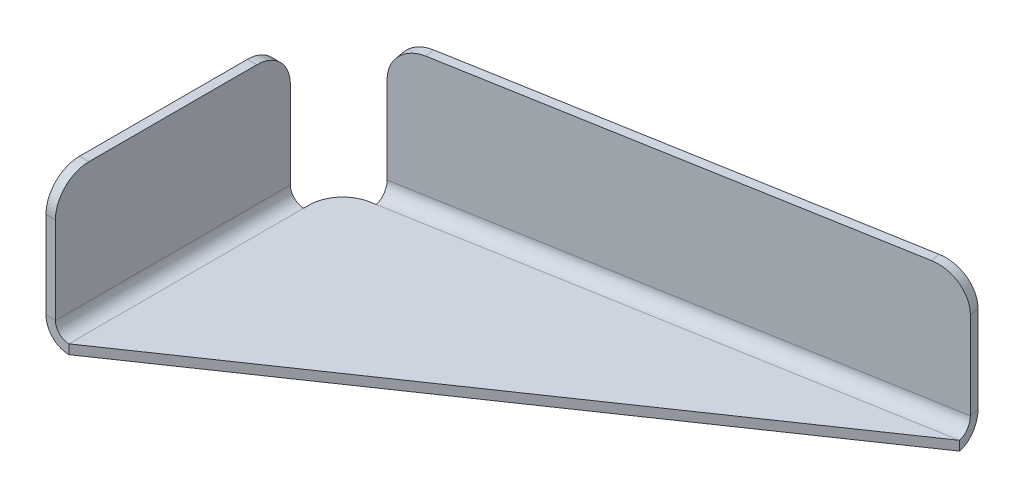
ISO-10303-21;
HEADER;
FILE_DESCRIPTION(('STEP AP214'),'2;1');
FILE_NAME('part.step','',(''),(''),'','','');
FILE_SCHEMA(('AUTOMOTIVE_DESIGN { 1 0 10303 214 1 1 1 1 }'));
ENDSEC;
DATA;
#1=APPLICATION_CONTEXT('core data for automotive mechanical design processes');
#2=APPLICATION_PROTOCOL_DEFINITION('international standard','automotive_design',2000,#1);
#3=PRODUCT_CONTEXT('',#1,'mechanical');
#4=PRODUCT('Part','Part','',(#3));
#5=PRODUCT_RELATED_PRODUCT_CATEGORY('part','',(#4));
#6=PRODUCT_DEFINITION_FORMATION('','',#4);
#7=PRODUCT_DEFINITION_CONTEXT('part definition',#1,'design');
#8=PRODUCT_DEFINITION('design','',#6,#7);
#9=PRODUCT_DEFINITION_SHAPE('','',#8);
#10=(LENGTH_UNIT() NAMED_UNIT(*) SI_UNIT(.MILLI.,.METRE.));
#11=(NAMED_UNIT(*) PLANE_ANGLE_UNIT() SI_UNIT($,.RADIAN.));
#12=(NAMED_UNIT(*) SI_UNIT($,.STERADIAN.) SOLID_ANGLE_UNIT());
#13=UNCERTAINTY_MEASURE_WITH_UNIT(LENGTH_MEASURE(1.E-05),#10,'distance_accuracy_value','');
#14=(GEOMETRIC_REPRESENTATION_CONTEXT(3) GLOBAL_UNCERTAINTY_ASSIGNED_CONTEXT((#13)) GLOBAL_UNIT_ASSIGNED_CONTEXT((#10,
#11,#12)) REPRESENTATION_CONTEXT('',''));
#15=CARTESIAN_POINT('',(0.,0.,0.));
#16=DIRECTION('',(0.,0.,1.));
#17=DIRECTION('',(1.,0.,0.));
#18=AXIS2_PLACEMENT_3D('',#15,#16,#17);
#19=CARTESIAN_POINT('',(39.3923101204883,-0.7,-6.94592710667709));
#20=DIRECTION('',(-0.173648177666927,0.,-0.984807753012209));
#21=DIRECTION('',(-0.984807753012209,0.,0.173648177666927));
#22=AXIS2_PLACEMENT_3D('',#19,#20,#21);
#23=PLANE('',#22);
#24=DIRECTION('',(-0.984807753012209,0.,0.173648177666927));
#25=VECTOR('',#24,1.);
#26=CARTESIAN_POINT('',(39.3923101204883,-0.7,-6.94592710667709));
#27=LINE('',#26,#25);
#28=CARTESIAN_POINT('',(2.46201938253052,-0.7,-0.434120444167318));
#29=VERTEX_POINT('',#28);
#30=CARTESIAN_POINT('',(2.06587955583269,-0.7,-0.364270304587316));
#31=VERTEX_POINT('',#30);
#32=EDGE_CURVE('E321',#29,#31,#27,.T.);
#33=ORIENTED_EDGE('',*,*,#32,.T.);
#34=DIRECTION('',(0.,1.,0.));
#35=VECTOR('',#34,1.);
#36=CARTESIAN_POINT('',(2.06587955583269,-0.7,-0.364270304587315));
#37=LINE('',#36,#35);
#38=CARTESIAN_POINT('',(2.06587955583269,0.,-0.364270304587316));
#39=VERTEX_POINT('',#38);
#40=EDGE_CURVE('E305',#31,#39,#37,.T.);
#41=ORIENTED_EDGE('',*,*,#40,.T.);
#42=DIRECTION('',(-0.984807753012209,0.,0.173648177666927));
#43=VECTOR('',#42,1.);
#44=CARTESIAN_POINT('',(39.3923101204883,0.,-6.94592710667709));
#45=LINE('',#44,#43);
#46=CARTESIAN_POINT('',(2.46201938253052,0.,-0.434120444167317));
#47=VERTEX_POINT('',#46);
#48=EDGE_CURVE('E332',#47,#39,#45,.T.);
#49=ORIENTED_EDGE('',*,*,#48,.F.);
#50=DIRECTION('',(0.,-1.,0.));
#51=VECTOR('',#50,1.);
#52=CARTESIAN_POINT('',(2.46201938253052,0.,-0.434120444167317));
#53=LINE('',#52,#51);
#54=EDGE_CURVE('E254',#47,#29,#53,.T.);
#55=ORIENTED_EDGE('',*,*,#54,.T.);
#56=EDGE_LOOP('',(#33,#41,#49,#55));
#57=FACE_BOUND('',#56,.T.);
#58=ADVANCED_FACE('F76',(#57),#23,.T.);
#59=CARTESIAN_POINT('',(0.,-0.7,20.));
#60=DIRECTION('',(0.564588205124679,0.,0.825372739211862));
#61=DIRECTION('',(0.825372739211862,0.,-0.564588205124679));
#62=AXIS2_PLACEMENT_3D('',#59,#60,#61);
#63=PLANE('',#62);
#64=DIRECTION('',(0.825372739211862,0.,-0.564588205124679));
#65=VECTOR('',#64,1.);
#66=CARTESIAN_POINT('',(0.,0.,20.));
#67=LINE('',#66,#65);
#68=CARTESIAN_POINT('',(0.,0.,20.));
#69=VERTEX_POINT('',#68);
#70=CARTESIAN_POINT('',(39.3923101204883,0.,-6.94592710667709));
#71=VERTEX_POINT('',#70);
#72=EDGE_CURVE('E311',#69,#71,#67,.T.);
#73=ORIENTED_EDGE('',*,*,#72,.F.);
#74=DIRECTION('',(0.,1.,0.));
#75=VECTOR('',#74,1.);
#76=CARTESIAN_POINT('',(0.,-0.7,20.));
#77=LINE('',#76,#75);
#78=CARTESIAN_POINT('',(0.,-0.7,20.));
#79=VERTEX_POINT('',#78);
#80=EDGE_CURVE('E324',#79,#69,#77,.T.);
#81=ORIENTED_EDGE('',*,*,#80,.F.);
#82=DIRECTION('',(0.825372739211862,0.,-0.564588205124679));
#83=VECTOR('',#82,1.);
#84=CARTESIAN_POINT('',(0.,-0.7,20.));
#85=LINE('',#84,#83);
#86=CARTESIAN_POINT('',(39.3923101204884,-0.700000000000008,-6.94592710667709));
#87=VERTEX_POINT('',#86);
#88=EDGE_CURVE('E327',#79,#87,#85,.T.);
#89=ORIENTED_EDGE('',*,*,#88,.T.);
#90=DIRECTION('',(0.,1.,0.));
#91=VECTOR('',#90,1.);
#92=CARTESIAN_POINT('',(39.3923101204883,-0.7,-6.94592710667709));
#93=LINE('',#92,#91);
#94=EDGE_CURVE('E273',#87,#71,#93,.T.);
#95=ORIENTED_EDGE('',*,*,#94,.T.);
#96=EDGE_LOOP('',(#73,#81,#89,#95));
#97=FACE_BOUND('',#96,.T.);
#98=ADVANCED_FACE('F400',(#97),#63,.T.);
#99=CARTESIAN_POINT('',(0.,-0.7,0.));
#100=DIRECTION('',(-1.,0.,0.));
#101=DIRECTION('',(0.,0.,1.));
#102=AXIS2_PLACEMENT_3D('',#99,#100,#101);
#103=PLANE('',#102);
#104=DIRECTION('',(0.,0.,1.));
#105=VECTOR('',#104,1.);
#106=CARTESIAN_POINT('',(0.,0.,0.));
#107=LINE('',#106,#105);
#108=CARTESIAN_POINT('',(0.,0.,2.09774907794321));
#109=VERTEX_POINT('',#108);
#110=CARTESIAN_POINT('',(0.,0.,2.5));
#111=VERTEX_POINT('',#110);
#112=EDGE_CURVE('E308',#109,#111,#107,.T.);
#113=ORIENTED_EDGE('',*,*,#112,.F.);
#114=DIRECTION('',(0.,1.,0.));
#115=VECTOR('',#114,1.);
#116=CARTESIAN_POINT('',(0.,-0.7,2.09774907794321));
#117=LINE('',#116,#115);
#118=CARTESIAN_POINT('',(0.,-0.7,2.09774907794321));
#119=VERTEX_POINT('',#118);
#120=EDGE_CURVE('E84',#109,#119,#117,.F.);
#121=ORIENTED_EDGE('',*,*,#120,.T.);
#122=DIRECTION('',(0.,0.,1.));
#123=VECTOR('',#122,1.);
#124=CARTESIAN_POINT('',(0.,-0.7,0.));
#125=LINE('',#124,#123);
#126=CARTESIAN_POINT('',(0.,-0.699999999999999,2.5));
#127=VERTEX_POINT('',#126);
#128=EDGE_CURVE('E348',#119,#127,#125,.T.);
#129=ORIENTED_EDGE('',*,*,#128,.T.);
#130=DIRECTION('',(0.,-1.,0.));
#131=VECTOR('',#130,1.);
#132=CARTESIAN_POINT('',(0.,0.,2.5));
#133=LINE('',#132,#131);
#134=EDGE_CURVE('E328',#111,#127,#133,.T.);
#135=ORIENTED_EDGE('',*,*,#134,.F.);
#136=EDGE_LOOP('',(#113,#121,#129,#135));
#137=FACE_BOUND('',#136,.T.);
#138=ADVANCED_FACE('F362',(#137),#103,.T.);
#139=CARTESIAN_POINT('',(0.,-0.7,0.));
#140=DIRECTION('',(0.,1.,0.));
#141=DIRECTION('',(0.,0.,1.));
#142=AXIS2_PLACEMENT_3D('',#139,#140,#141);
#143=PLANE('',#142);
#144=ORIENTED_EDGE('',*,*,#128,.F.);
#145=CARTESIAN_POINT('',(2.5,-0.7,2.09774907794321));
#146=DIRECTION('',(0.,1.,0.));
#147=DIRECTION('',(0.,0.,1.));
#148=AXIS2_PLACEMENT_3D('',#145,#146,#147);
#149=CIRCLE('',#148,2.5);
#150=EDGE_CURVE('E13',#119,#31,#149,.F.);
#151=ORIENTED_EDGE('',*,*,#150,.T.);
#152=ORIENTED_EDGE('',*,*,#32,.F.);
#153=EDGE_CURVE('E207',#87,#29,#27,.T.);
#154=ORIENTED_EDGE('',*,*,#153,.F.);
#155=ORIENTED_EDGE('',*,*,#88,.F.);
#156=DIRECTION('',(0.,0.,1.));
#157=VECTOR('',#156,1.);
#158=CARTESIAN_POINT('',(0.,-0.699999999999999,20.));
#159=LINE('',#158,#157);
#160=EDGE_CURVE('E334',#79,#127,#159,.F.);
#161=ORIENTED_EDGE('',*,*,#160,.T.);
#162=EDGE_LOOP('',(#144,#151,#152,#154,#155,#161));
#163=FACE_BOUND('',#162,.T.);
#164=ADVANCED_FACE('F357',(#163),#143,.F.);
#165=CARTESIAN_POINT('',(0.,0.,0.));
#166=DIRECTION('',(0.,1.,0.));
#167=DIRECTION('',(0.,0.,1.));
#168=AXIS2_PLACEMENT_3D('',#165,#166,#167);
#169=PLANE('',#168);
#170=ORIENTED_EDGE('',*,*,#48,.T.);
#171=CARTESIAN_POINT('',(2.5,0.,2.09774907794321));
#172=DIRECTION('',(0.,1.,0.));
#173=DIRECTION('',(0.,0.,1.));
#174=AXIS2_PLACEMENT_3D('',#171,#172,#173);
#175=CIRCLE('',#174,2.5);
#176=EDGE_CURVE('E98',#39,#109,#175,.T.);
#177=ORIENTED_EDGE('',*,*,#176,.T.);
#178=ORIENTED_EDGE('',*,*,#112,.T.);
#179=DIRECTION('',(0.,0.,1.));
#180=VECTOR('',#179,1.);
#181=CARTESIAN_POINT('',(0.,0.,20.));
#182=LINE('',#181,#180);
#183=EDGE_CURVE('E371',#69,#111,#182,.F.);
#184=ORIENTED_EDGE('',*,*,#183,.F.);
#185=ORIENTED_EDGE('',*,*,#72,.T.);
#186=EDGE_CURVE('E312',#71,#47,#45,.T.);
#187=ORIENTED_EDGE('',*,*,#186,.T.);
#188=EDGE_LOOP('',(#170,#177,#178,#184,#185,#187));
#189=FACE_BOUND('',#188,.T.);
#190=ADVANCED_FACE('F390',(#189),#169,.T.);
#191=CARTESIAN_POINT('',(0.,1.,2.5));
#192=DIRECTION('',(0.,0.,-1.));
#193=DIRECTION('',(-1.,0.,0.));
#194=AXIS2_PLACEMENT_3D('',#191,#192,#193);
#195=PLANE('',#194);
#196=DIRECTION('',(1.,0.,0.));
#197=VECTOR('',#196,1.);
#198=CARTESIAN_POINT('',(-1.7,0.999999999999994,2.5));
#199=LINE('',#198,#197);
#200=CARTESIAN_POINT('',(-0.999999999999999,0.999999999999997,2.5));
#201=VERTEX_POINT('',#200);
#202=CARTESIAN_POINT('',(-1.7,0.999999999999994,2.5));
#203=VERTEX_POINT('',#202);
#204=EDGE_CURVE('E264',#201,#203,#199,.F.);
#205=ORIENTED_EDGE('',*,*,#204,.F.);
#206=CARTESIAN_POINT('',(0.,1.,2.5));
#207=DIRECTION('',(0.,0.,1.));
#208=DIRECTION('',(1.,0.,0.));
#209=AXIS2_PLACEMENT_3D('',#206,#207,#208);
#210=CIRCLE('',#209,0.999999999999999);
#211=EDGE_CURVE('E373',#111,#201,#210,.F.);
#212=ORIENTED_EDGE('',*,*,#211,.F.);
#213=ORIENTED_EDGE('',*,*,#134,.T.);
#214=CARTESIAN_POINT('',(0.,1.,2.5));
#215=DIRECTION('',(0.,0.,1.));
#216=DIRECTION('',(1.,0.,0.));
#217=AXIS2_PLACEMENT_3D('',#214,#215,#216);
#218=CIRCLE('',#217,1.7);
#219=EDGE_CURVE('E333',#127,#203,#218,.F.);
#220=ORIENTED_EDGE('',*,*,#219,.T.);
#221=EDGE_LOOP('',(#205,#212,#213,#220));
#222=FACE_BOUND('',#221,.T.);
#223=ADVANCED_FACE('F379',(#222),#195,.T.);
#224=CARTESIAN_POINT('',(0.,1.,20.));
#225=DIRECTION('',(0.,0.,-1.));
#226=DIRECTION('',(-1.,0.,0.));
#227=AXIS2_PLACEMENT_3D('',#224,#225,#226);
#228=PLANE('',#227);
#229=CARTESIAN_POINT('',(0.,1.,20.));
#230=DIRECTION('',(0.,0.,1.));
#231=DIRECTION('',(1.,0.,0.));
#232=AXIS2_PLACEMENT_3D('',#229,#230,#231);
#233=CIRCLE('',#232,0.999999999999999);
#234=CARTESIAN_POINT('',(-0.999999999999996,0.999999999999997,20.));
#235=VERTEX_POINT('',#234);
#236=EDGE_CURVE('E339',#235,#69,#233,.T.);
#237=ORIENTED_EDGE('',*,*,#236,.F.);
#238=DIRECTION('',(1.,0.,0.));
#239=VECTOR('',#238,1.);
#240=CARTESIAN_POINT('',(-0.999999999999998,0.999999999999997,20.));
#241=LINE('',#240,#239);
#242=CARTESIAN_POINT('',(-1.7,0.999999999999995,20.));
#243=VERTEX_POINT('',#242);
#244=EDGE_CURVE('E408',#235,#243,#241,.F.);
#245=ORIENTED_EDGE('',*,*,#244,.T.);
#246=CARTESIAN_POINT('',(0.,1.,20.));
#247=DIRECTION('',(0.,0.,1.));
#248=DIRECTION('',(1.,0.,0.));
#249=AXIS2_PLACEMENT_3D('',#246,#247,#248);
#250=CIRCLE('',#249,1.7);
#251=EDGE_CURVE('E381',#243,#79,#250,.T.);
#252=ORIENTED_EDGE('',*,*,#251,.T.);
#253=ORIENTED_EDGE('',*,*,#80,.T.);
#254=EDGE_LOOP('',(#237,#245,#252,#253));
#255=FACE_BOUND('',#254,.T.);
#256=ADVANCED_FACE('F406',(#255),#228,.F.);
#257=CARTESIAN_POINT('',(0.,1.,20.));
#258=DIRECTION('',(0.,0.,1.));
#259=DIRECTION('',(-1.,0.,0.));
#260=AXIS2_PLACEMENT_3D('',#257,#258,#259);
#261=CYLINDRICAL_SURFACE('',#260,1.7);
#262=ORIENTED_EDGE('',*,*,#160,.F.);
#263=ORIENTED_EDGE('',*,*,#251,.F.);
#264=DIRECTION('',(0.,0.,1.));
#265=VECTOR('',#264,1.);
#266=CARTESIAN_POINT('',(-1.7,0.999999999999994,2.5));
#267=LINE('',#266,#265);
#268=EDGE_CURVE('E414',#243,#203,#267,.F.);
#269=ORIENTED_EDGE('',*,*,#268,.T.);
#270=ORIENTED_EDGE('',*,*,#219,.F.);
#271=EDGE_LOOP('',(#262,#263,#269,#270));
#272=FACE_BOUND('',#271,.T.);
#273=ADVANCED_FACE('F402',(#272),#261,.T.);
#274=CARTESIAN_POINT('',(0.,1.,20.));
#275=DIRECTION('',(0.,0.,1.));
#276=DIRECTION('',(-1.,0.,0.));
#277=AXIS2_PLACEMENT_3D('',#274,#275,#276);
#278=CYLINDRICAL_SURFACE('',#277,0.999999999999999);
#279=ORIENTED_EDGE('',*,*,#183,.T.);
#280=ORIENTED_EDGE('',*,*,#211,.T.);
#281=DIRECTION('',(0.,0.,1.));
#282=VECTOR('',#281,1.);
#283=CARTESIAN_POINT('',(-1.,0.999999999999996,2.5));
#284=LINE('',#283,#282);
#285=EDGE_CURVE('E415',#201,#235,#284,.T.);
#286=ORIENTED_EDGE('',*,*,#285,.T.);
#287=ORIENTED_EDGE('',*,*,#236,.T.);
#288=EDGE_LOOP('',(#279,#280,#286,#287));
#289=FACE_BOUND('',#288,.T.);
#290=ADVANCED_FACE('F372',(#289),#278,.F.);
#291=CARTESIAN_POINT('',(-1.7,0.,2.5));
#292=DIRECTION('',(0.,0.,1.));
#293=DIRECTION('',(1.,0.,0.));
#294=AXIS2_PLACEMENT_3D('',#291,#292,#293);
#295=PLANE('',#294);
#296=DIRECTION('',(0.,-1.,0.));
#297=VECTOR('',#296,1.);
#298=CARTESIAN_POINT('',(-1.7,0.,2.5));
#299=LINE('',#298,#297);
#300=CARTESIAN_POINT('',(-1.70000000000002,7.5,2.5));
#301=VERTEX_POINT('',#300);
#302=EDGE_CURVE('E424',#301,#203,#299,.T.);
#303=ORIENTED_EDGE('',*,*,#302,.F.);
#304=DIRECTION('',(1.,0.,0.));
#305=VECTOR('',#304,1.);
#306=CARTESIAN_POINT('',(-1.70000000000002,7.5,2.5));
#307=LINE('',#306,#305);
#308=CARTESIAN_POINT('',(-1.00000000000002,7.5,2.5));
#309=VERTEX_POINT('',#308);
#310=EDGE_CURVE('E287',#301,#309,#307,.T.);
#311=ORIENTED_EDGE('',*,*,#310,.T.);
#312=DIRECTION('',(0.,1.,0.));
#313=VECTOR('',#312,1.);
#314=CARTESIAN_POINT('',(-0.999999999999996,0.,2.5));
#315=LINE('',#314,#313);
#316=EDGE_CURVE('E425',#309,#201,#315,.F.);
#317=ORIENTED_EDGE('',*,*,#316,.T.);
#318=ORIENTED_EDGE('',*,*,#204,.T.);
#319=EDGE_LOOP('',(#303,#311,#317,#318));
#320=FACE_BOUND('',#319,.T.);
#321=ADVANCED_FACE('F439',(#320),#295,.F.);
#322=CARTESIAN_POINT('',(-1.70000000000003,10.,20.));
#323=DIRECTION('',(0.,0.,-1.));
#324=DIRECTION('',(-1.,0.,0.));
#325=AXIS2_PLACEMENT_3D('',#322,#323,#324);
#326=PLANE('',#325);
#327=DIRECTION('',(0.,-1.,0.));
#328=VECTOR('',#327,1.);
#329=CARTESIAN_POINT('',(-1.00000000000003,10.,20.));
#330=LINE('',#329,#328);
#331=CARTESIAN_POINT('',(-1.00000000000002,7.5,20.));
#332=VERTEX_POINT('',#331);
#333=EDGE_CURVE('E434',#235,#332,#330,.F.);
#334=ORIENTED_EDGE('',*,*,#333,.T.);
#335=DIRECTION('',(1.,0.,0.));
#336=VECTOR('',#335,1.);
#337=CARTESIAN_POINT('',(-1.70000000000002,7.5,20.));
#338=LINE('',#337,#336);
#339=CARTESIAN_POINT('',(-1.70000000000002,7.5,20.));
#340=VERTEX_POINT('',#339);
#341=EDGE_CURVE('E303',#332,#340,#338,.F.);
#342=ORIENTED_EDGE('',*,*,#341,.T.);
#343=DIRECTION('',(0.,1.,0.));
#344=VECTOR('',#343,1.);
#345=CARTESIAN_POINT('',(-1.69999999999999,0.,20.));
#346=LINE('',#345,#344);
#347=EDGE_CURVE('E421',#243,#340,#346,.T.);
#348=ORIENTED_EDGE('',*,*,#347,.F.);
#349=ORIENTED_EDGE('',*,*,#244,.F.);
#350=EDGE_LOOP('',(#334,#342,#348,#349));
#351=FACE_BOUND('',#350,.T.);
#352=ADVANCED_FACE('F427',(#351),#326,.F.);
#353=CARTESIAN_POINT('',(-1.7,0.,0.));
#354=DIRECTION('',(1.,0.,0.));
#355=DIRECTION('',(0.,1.,0.));
#356=AXIS2_PLACEMENT_3D('',#353,#354,#355);
#357=PLANE('',#356);
#358=DIRECTION('',(0.,0.,-1.));
#359=VECTOR('',#358,1.);
#360=CARTESIAN_POINT('',(-1.70000000000003,10.,0.));
#361=LINE('',#360,#359);
#362=CARTESIAN_POINT('',(-1.70000000000003,10.,17.5));
#363=VERTEX_POINT('',#362);
#364=CARTESIAN_POINT('',(-1.70000000000003,10.,5.));
#365=VERTEX_POINT('',#364);
#366=EDGE_CURVE('E259',#363,#365,#361,.T.);
#367=ORIENTED_EDGE('',*,*,#366,.T.);
#368=CARTESIAN_POINT('',(-1.70000000000002,7.5,5.));
#369=DIRECTION('',(1.,0.,0.));
#370=DIRECTION('',(0.,1.,0.));
#371=AXIS2_PLACEMENT_3D('',#368,#369,#370);
#372=CIRCLE('',#371,2.5);
#373=EDGE_CURVE('E301',#365,#301,#372,.F.);
#374=ORIENTED_EDGE('',*,*,#373,.T.);
#375=ORIENTED_EDGE('',*,*,#302,.T.);
#376=ORIENTED_EDGE('',*,*,#268,.F.);
#377=ORIENTED_EDGE('',*,*,#347,.T.);
#378=CARTESIAN_POINT('',(-1.70000000000002,7.5,17.5));
#379=DIRECTION('',(1.,0.,0.));
#380=DIRECTION('',(0.,1.,0.));
#381=AXIS2_PLACEMENT_3D('',#378,#379,#380);
#382=CIRCLE('',#381,2.5);
#383=EDGE_CURVE('E299',#340,#363,#382,.F.);
#384=ORIENTED_EDGE('',*,*,#383,.T.);
#385=EDGE_LOOP('',(#367,#374,#375,#376,#377,#384));
#386=FACE_BOUND('',#385,.T.);
#387=ADVANCED_FACE('F420',(#386),#357,.F.);
#388=CARTESIAN_POINT('',(-0.999999999999997,0.,0.));
#389=DIRECTION('',(1.,0.,0.));
#390=DIRECTION('',(0.,1.,0.));
#391=AXIS2_PLACEMENT_3D('',#388,#389,#390);
#392=PLANE('',#391);
#393=ORIENTED_EDGE('',*,*,#316,.F.);
#394=CARTESIAN_POINT('',(-1.00000000000002,7.5,5.));
#395=DIRECTION('',(1.,0.,0.));
#396=DIRECTION('',(0.,1.,0.));
#397=AXIS2_PLACEMENT_3D('',#394,#395,#396);
#398=CIRCLE('',#397,2.5);
#399=CARTESIAN_POINT('',(-1.00000000000003,10.,5.));
#400=VERTEX_POINT('',#399);
#401=EDGE_CURVE('E292',#309,#400,#398,.T.);
#402=ORIENTED_EDGE('',*,*,#401,.T.);
#403=DIRECTION('',(0.,0.,1.));
#404=VECTOR('',#403,1.);
#405=CARTESIAN_POINT('',(-1.00000000000003,10.,2.5));
#406=LINE('',#405,#404);
#407=CARTESIAN_POINT('',(-1.00000000000003,10.,17.5));
#408=VERTEX_POINT('',#407);
#409=EDGE_CURVE('E429',#408,#400,#406,.F.);
#410=ORIENTED_EDGE('',*,*,#409,.F.);
#411=CARTESIAN_POINT('',(-1.00000000000002,7.5,17.5));
#412=DIRECTION('',(1.,0.,0.));
#413=DIRECTION('',(0.,1.,0.));
#414=AXIS2_PLACEMENT_3D('',#411,#412,#413);
#415=CIRCLE('',#414,2.5);
#416=EDGE_CURVE('E290',#408,#332,#415,.T.);
#417=ORIENTED_EDGE('',*,*,#416,.T.);
#418=ORIENTED_EDGE('',*,*,#333,.F.);
#419=ORIENTED_EDGE('',*,*,#285,.F.);
#420=EDGE_LOOP('',(#393,#402,#410,#417,#418,#419));
#421=FACE_BOUND('',#420,.T.);
#422=ADVANCED_FACE('F443',(#421),#392,.T.);
#423=CARTESIAN_POINT('',(-1.70000000000003,10.,2.5));
#424=DIRECTION('',(0.,-1.,0.));
#425=DIRECTION('',(1.,0.,0.));
#426=AXIS2_PLACEMENT_3D('',#423,#424,#425);
#427=PLANE('',#426);
#428=ORIENTED_EDGE('',*,*,#409,.T.);
#429=DIRECTION('',(1.,0.,0.));
#430=VECTOR('',#429,1.);
#431=CARTESIAN_POINT('',(-1.70000000000003,10.,5.));
#432=LINE('',#431,#430);
#433=EDGE_CURVE('E297',#400,#365,#432,.F.);
#434=ORIENTED_EDGE('',*,*,#433,.T.);
#435=ORIENTED_EDGE('',*,*,#366,.F.);
#436=DIRECTION('',(1.,0.,0.));
#437=VECTOR('',#436,1.);
#438=CARTESIAN_POINT('',(-1.70000000000003,10.,17.5));
#439=LINE('',#438,#437);
#440=EDGE_CURVE('E294',#363,#408,#439,.T.);
#441=ORIENTED_EDGE('',*,*,#440,.T.);
#442=EDGE_LOOP('',(#428,#434,#435,#441));
#443=FACE_BOUND('',#442,.T.);
#444=ADVANCED_FACE('F451',(#443),#427,.F.);
#445=CARTESIAN_POINT('',(39.3923101204883,0.999999999999997,-6.94592710667709));
#446=DIRECTION('',(0.984807753012209,0.,-0.173648177666927));
#447=DIRECTION('',(-0.173648177666927,0.,-0.984807753012209));
#448=AXIS2_PLACEMENT_3D('',#445,#446,#447);
#449=PLANE('',#448);
#450=DIRECTION('',(0.173648177666927,0.,0.984807753012209));
#451=VECTOR('',#450,1.);
#452=CARTESIAN_POINT('',(39.0971082184546,0.999999999999992,-8.62010028679785));
#453=LINE('',#452,#451);
#454=CARTESIAN_POINT('',(39.2186619428214,0.999999999999993,-7.9307348596893));
#455=VERTEX_POINT('',#454);
#456=CARTESIAN_POINT('',(39.0971082184546,0.99999999999999,-8.62010028679785));
#457=VERTEX_POINT('',#456);
#458=EDGE_CURVE('E250',#455,#457,#453,.F.);
#459=ORIENTED_EDGE('',*,*,#458,.F.);
#460=CARTESIAN_POINT('',(39.3923101204883,0.999999999999997,-6.94592710667709));
#461=DIRECTION('',(-0.984807753012209,0.,0.173648177666927));
#462=DIRECTION('',(0.173648177666927,0.,0.984807753012209));
#463=AXIS2_PLACEMENT_3D('',#460,#461,#462);
#464=CIRCLE('',#463,1.00000000000001);
#465=EDGE_CURVE('E211',#71,#455,#464,.F.);
#466=ORIENTED_EDGE('',*,*,#465,.F.);
#467=ORIENTED_EDGE('',*,*,#94,.F.);
#468=CARTESIAN_POINT('',(39.3923101204884,0.999999999999997,-6.94592710667709));
#469=DIRECTION('',(-0.984807753012209,0.,0.173648177666927));
#470=DIRECTION('',(0.173648177666927,0.,0.984807753012209));
#471=AXIS2_PLACEMENT_3D('',#468,#469,#470);
#472=CIRCLE('',#471,1.7);
#473=EDGE_CURVE('E210',#87,#457,#472,.F.);
#474=ORIENTED_EDGE('',*,*,#473,.T.);
#475=EDGE_LOOP('',(#459,#466,#467,#474));
#476=FACE_BOUND('',#475,.T.);
#477=ADVANCED_FACE('F397',(#476),#449,.T.);
#478=CARTESIAN_POINT('',(2.46201938253052,1.,-0.43412044416732));
#479=DIRECTION('',(0.984807753012209,0.,-0.173648177666927));
#480=DIRECTION('',(-0.173648177666927,0.,-0.984807753012209));
#481=AXIS2_PLACEMENT_3D('',#478,#479,#480);
#482=PLANE('',#481);
#483=CARTESIAN_POINT('',(2.46201938253052,1.,-0.43412044416732));
#484=DIRECTION('',(-0.984807753012209,0.,0.173648177666927));
#485=DIRECTION('',(0.173648177666927,0.,0.984807753012209));
#486=AXIS2_PLACEMENT_3D('',#483,#484,#485);
#487=CIRCLE('',#486,1.00000000000001);
#488=CARTESIAN_POINT('',(2.28837120486359,0.999999999999997,-1.41892819717953));
#489=VERTEX_POINT('',#488);
#490=EDGE_CURVE('E218',#489,#47,#487,.T.);
#491=ORIENTED_EDGE('',*,*,#490,.F.);
#492=DIRECTION('',(0.173648177666927,0.,0.984807753012209));
#493=VECTOR('',#492,1.);
#494=CARTESIAN_POINT('',(2.2883712048636,0.999999999999996,-1.41892819717953));
#495=LINE('',#494,#493);
#496=CARTESIAN_POINT('',(2.16681748049675,0.999999999999994,-2.10829362428807));
#497=VERTEX_POINT('',#496);
#498=EDGE_CURVE('E215',#489,#497,#495,.F.);
#499=ORIENTED_EDGE('',*,*,#498,.T.);
#500=CARTESIAN_POINT('',(2.46201938253052,1.,-0.43412044416732));
#501=DIRECTION('',(-0.984807753012209,0.,0.173648177666927));
#502=DIRECTION('',(0.173648177666927,0.,0.984807753012209));
#503=AXIS2_PLACEMENT_3D('',#500,#501,#502);
#504=CIRCLE('',#503,1.7);
#505=EDGE_CURVE('E199',#497,#29,#504,.T.);
#506=ORIENTED_EDGE('',*,*,#505,.T.);
#507=ORIENTED_EDGE('',*,*,#54,.F.);
#508=EDGE_LOOP('',(#491,#499,#506,#507));
#509=FACE_BOUND('',#508,.T.);
#510=ADVANCED_FACE('F216',(#509),#482,.F.);
#511=CARTESIAN_POINT('',(2.46201938253052,1.,-0.43412044416732));
#512=DIRECTION('',(-0.984807753012209,0.,0.173648177666927));
#513=DIRECTION('',(-0.173648177666927,0.,-0.984807753012209));
#514=AXIS2_PLACEMENT_3D('',#511,#512,#513);
#515=CYLINDRICAL_SURFACE('',#514,1.7);
#516=ORIENTED_EDGE('',*,*,#153,.T.);
#517=ORIENTED_EDGE('',*,*,#505,.F.);
#518=DIRECTION('',(-0.984807753012209,0.,0.173648177666927));
#519=VECTOR('',#518,1.);
#520=CARTESIAN_POINT('',(39.0971082184546,0.999999999999992,-8.62010028679785));
#521=LINE('',#520,#519);
#522=EDGE_CURVE('E204',#497,#457,#521,.F.);
#523=ORIENTED_EDGE('',*,*,#522,.T.);
#524=ORIENTED_EDGE('',*,*,#473,.F.);
#525=EDGE_LOOP('',(#516,#517,#523,#524));
#526=FACE_BOUND('',#525,.T.);
#527=ADVANCED_FACE('F201',(#526),#515,.T.);
#528=CARTESIAN_POINT('',(2.46201938253052,1.,-0.43412044416732));
#529=DIRECTION('',(-0.984807753012209,0.,0.173648177666927));
#530=DIRECTION('',(-0.173648177666927,0.,-0.984807753012209));
#531=AXIS2_PLACEMENT_3D('',#528,#529,#530);
#532=CYLINDRICAL_SURFACE('',#531,1.00000000000001);
#533=ORIENTED_EDGE('',*,*,#186,.F.);
#534=ORIENTED_EDGE('',*,*,#465,.T.);
#535=DIRECTION('',(-0.984807753012209,0.,0.173648177666927));
#536=VECTOR('',#535,1.);
#537=CARTESIAN_POINT('',(39.2186619428214,0.999999999999995,-7.9307348596893));
#538=LINE('',#537,#536);
#539=EDGE_CURVE('E223',#455,#489,#538,.T.);
#540=ORIENTED_EDGE('',*,*,#539,.T.);
#541=ORIENTED_EDGE('',*,*,#490,.T.);
#542=EDGE_LOOP('',(#533,#534,#540,#541));
#543=FACE_BOUND('',#542,.T.);
#544=ADVANCED_FACE('F393',(#543),#532,.F.);
#545=CARTESIAN_POINT('',(39.0971082184546,0.,-8.62010028679784));
#546=DIRECTION('',(-0.984807753012209,0.,0.173648177666927));
#547=DIRECTION('',(0.173648177666927,0.,0.984807753012209));
#548=AXIS2_PLACEMENT_3D('',#545,#546,#547);
#549=PLANE('',#548);
#550=DIRECTION('',(0.,-1.,0.));
#551=VECTOR('',#550,1.);
#552=CARTESIAN_POINT('',(39.0971082184546,0.,-8.62010028679784));
#553=LINE('',#552,#551);
#554=CARTESIAN_POINT('',(39.0971082184546,7.5,-8.62010028679787));
#555=VERTEX_POINT('',#554);
#556=EDGE_CURVE('E232',#555,#457,#553,.T.);
#557=ORIENTED_EDGE('',*,*,#556,.F.);
#558=DIRECTION('',(0.173648177666927,0.,0.984807753012209));
#559=VECTOR('',#558,1.);
#560=CARTESIAN_POINT('',(39.0971082184546,7.5,-8.62010028679787));
#561=LINE('',#560,#559);
#562=CARTESIAN_POINT('',(39.2186619428214,7.5,-7.93073485968933));
#563=VERTEX_POINT('',#562);
#564=EDGE_CURVE('E269',#555,#563,#561,.T.);
#565=ORIENTED_EDGE('',*,*,#564,.T.);
#566=DIRECTION('',(0.,1.,0.));
#567=VECTOR('',#566,1.);
#568=CARTESIAN_POINT('',(39.2186619428214,0.,-7.9307348596893));
#569=LINE('',#568,#567);
#570=EDGE_CURVE('E233',#563,#455,#569,.F.);
#571=ORIENTED_EDGE('',*,*,#570,.T.);
#572=ORIENTED_EDGE('',*,*,#458,.T.);
#573=EDGE_LOOP('',(#557,#565,#571,#572));
#574=FACE_BOUND('',#573,.T.);
#575=ADVANCED_FACE('F487',(#574),#549,.F.);
#576=CARTESIAN_POINT('',(2.16681748049674,10.,-2.1082936242881));
#577=DIRECTION('',(0.984807753012209,0.,-0.173648177666927));
#578=DIRECTION('',(-0.173648177666927,0.,-0.984807753012209));
#579=AXIS2_PLACEMENT_3D('',#576,#577,#578);
#580=PLANE('',#579);
#581=DIRECTION('',(0.,-1.,0.));
#582=VECTOR('',#581,1.);
#583=CARTESIAN_POINT('',(2.28837120486359,10.,-1.41892819717956));
#584=LINE('',#583,#582);
#585=CARTESIAN_POINT('',(2.28837120486359,7.5,-1.41892819717955));
#586=VERTEX_POINT('',#585);
#587=EDGE_CURVE('E246',#489,#586,#584,.F.);
#588=ORIENTED_EDGE('',*,*,#587,.T.);
#589=DIRECTION('',(0.173648177666927,0.,0.984807753012209));
#590=VECTOR('',#589,1.);
#591=CARTESIAN_POINT('',(2.16681748049674,7.5,-2.1082936242881));
#592=LINE('',#591,#590);
#593=CARTESIAN_POINT('',(2.16681748049674,7.5,-2.1082936242881));
#594=VERTEX_POINT('',#593);
#595=EDGE_CURVE('E237',#586,#594,#592,.F.);
#596=ORIENTED_EDGE('',*,*,#595,.T.);
#597=DIRECTION('',(0.,1.,0.));
#598=VECTOR('',#597,1.);
#599=CARTESIAN_POINT('',(2.16681748049675,0.,-2.10829362428807));
#600=LINE('',#599,#598);
#601=EDGE_CURVE('E229',#497,#594,#600,.T.);
#602=ORIENTED_EDGE('',*,*,#601,.F.);
#603=ORIENTED_EDGE('',*,*,#498,.F.);
#604=EDGE_LOOP('',(#588,#596,#602,#603));
#605=FACE_BOUND('',#604,.T.);
#606=ADVANCED_FACE('F235',(#605),#580,.F.);
#607=CARTESIAN_POINT('',(-0.295201902033776,0.,-1.67417318012075));
#608=DIRECTION('',(0.173648177666927,0.,0.984807753012209));
#609=DIRECTION('',(0.984807753012209,0.,-0.173648177666927));
#610=AXIS2_PLACEMENT_3D('',#607,#608,#609);
#611=PLANE('',#610);
#612=DIRECTION('',(0.984807753012209,0.,-0.173648177666927));
#613=VECTOR('',#612,1.);
#614=CARTESIAN_POINT('',(-0.295201902033782,10.,-1.67417318012079));
#615=LINE('',#614,#613);
#616=CARTESIAN_POINT('',(4.62883686302727,10.,-2.54241406845542));
#617=VERTEX_POINT('',#616);
#618=CARTESIAN_POINT('',(36.635088835924,10.,-8.18597984263056));
#619=VERTEX_POINT('',#618);
#620=EDGE_CURVE('E238',#617,#619,#615,.T.);
#621=ORIENTED_EDGE('',*,*,#620,.T.);
#622=CARTESIAN_POINT('',(36.635088835924,7.5,-8.18597984263055));
#623=DIRECTION('',(0.173648177666927,0.,0.984807753012209));
#624=DIRECTION('',(0.984807753012209,0.,-0.173648177666927));
#625=AXIS2_PLACEMENT_3D('',#622,#623,#624);
#626=CIRCLE('',#625,2.5);
#627=EDGE_CURVE('E284',#619,#555,#626,.F.);
#628=ORIENTED_EDGE('',*,*,#627,.T.);
#629=ORIENTED_EDGE('',*,*,#556,.T.);
#630=ORIENTED_EDGE('',*,*,#522,.F.);
#631=ORIENTED_EDGE('',*,*,#601,.T.);
#632=CARTESIAN_POINT('',(4.62883686302727,7.5,-2.54241406845542));
#633=DIRECTION('',(0.173648177666927,0.,0.984807753012209));
#634=DIRECTION('',(0.984807753012209,0.,-0.173648177666927));
#635=AXIS2_PLACEMENT_3D('',#632,#633,#634);
#636=CIRCLE('',#635,2.5);
#637=EDGE_CURVE('E282',#594,#617,#636,.F.);
#638=ORIENTED_EDGE('',*,*,#637,.T.);
#639=EDGE_LOOP('',(#621,#628,#629,#630,#631,#638));
#640=FACE_BOUND('',#639,.T.);
#641=ADVANCED_FACE('F228',(#640),#611,.F.);
#642=CARTESIAN_POINT('',(-0.173648177666927,0.,-0.984807753012204));
#643=DIRECTION('',(0.173648177666927,0.,0.984807753012209));
#644=DIRECTION('',(0.984807753012209,0.,-0.173648177666927));
#645=AXIS2_PLACEMENT_3D('',#642,#643,#644);
#646=PLANE('',#645);
#647=ORIENTED_EDGE('',*,*,#570,.F.);
#648=CARTESIAN_POINT('',(36.7566425602909,7.5,-7.49661441552201));
#649=DIRECTION('',(0.173648177666927,0.,0.984807753012209));
#650=DIRECTION('',(0.984807753012209,0.,-0.173648177666927));
#651=AXIS2_PLACEMENT_3D('',#648,#649,#650);
#652=CIRCLE('',#651,2.5);
#653=CARTESIAN_POINT('',(36.7566425602909,10.,-7.49661441552202));
#654=VERTEX_POINT('',#653);
#655=EDGE_CURVE('E275',#563,#654,#652,.T.);
#656=ORIENTED_EDGE('',*,*,#655,.T.);
#657=DIRECTION('',(-0.984807753012209,0.,0.173648177666927));
#658=VECTOR('',#657,1.);
#659=CARTESIAN_POINT('',(39.2186619428214,10.,-7.93073485968933));
#660=LINE('',#659,#658);
#661=CARTESIAN_POINT('',(4.75039058739411,10.,-1.85304864134688));
#662=VERTEX_POINT('',#661);
#663=EDGE_CURVE('E241',#662,#654,#660,.F.);
#664=ORIENTED_EDGE('',*,*,#663,.F.);
#665=CARTESIAN_POINT('',(4.75039058739412,7.5,-1.85304864134687));
#666=DIRECTION('',(0.173648177666927,0.,0.984807753012209));
#667=DIRECTION('',(0.984807753012209,0.,-0.173648177666927));
#668=AXIS2_PLACEMENT_3D('',#665,#666,#667);
#669=CIRCLE('',#668,2.5);
#670=EDGE_CURVE('E272',#662,#586,#669,.T.);
#671=ORIENTED_EDGE('',*,*,#670,.T.);
#672=ORIENTED_EDGE('',*,*,#587,.F.);
#673=ORIENTED_EDGE('',*,*,#539,.F.);
#674=EDGE_LOOP('',(#647,#656,#664,#671,#672,#673));
#675=FACE_BOUND('',#674,.T.);
#676=ADVANCED_FACE('F479',(#675),#646,.T.);
#677=CARTESIAN_POINT('',(39.0971082184546,10.,-8.62010028679788));
#678=DIRECTION('',(0.,-1.,0.));
#679=DIRECTION('',(0.,0.,-1.));
#680=AXIS2_PLACEMENT_3D('',#677,#678,#679);
#681=PLANE('',#680);
#682=ORIENTED_EDGE('',*,*,#663,.T.);
#683=DIRECTION('',(0.173648177666927,0.,0.984807753012209));
#684=VECTOR('',#683,1.);
#685=CARTESIAN_POINT('',(36.635088835924,10.,-8.18597984263056));
#686=LINE('',#685,#684);
#687=EDGE_CURVE('E280',#654,#619,#686,.F.);
#688=ORIENTED_EDGE('',*,*,#687,.T.);
#689=ORIENTED_EDGE('',*,*,#620,.F.);
#690=DIRECTION('',(0.173648177666927,0.,0.984807753012209));
#691=VECTOR('',#690,1.);
#692=CARTESIAN_POINT('',(4.62883686302728,10.,-2.54241406845543));
#693=LINE('',#692,#691);
#694=EDGE_CURVE('E277',#617,#662,#693,.T.);
#695=ORIENTED_EDGE('',*,*,#694,.T.);
#696=EDGE_LOOP('',(#682,#688,#689,#695));
#697=FACE_BOUND('',#696,.T.);
#698=ADVANCED_FACE('F474',(#697),#681,.F.);
#699=CARTESIAN_POINT('',(36.635088835924,7.5,-8.18597984263055));
#700=DIRECTION('',(0.173648177666927,0.,0.984807753012209));
#701=DIRECTION('',(0.984807753012209,0.,-0.173648177666927));
#702=AXIS2_PLACEMENT_3D('',#699,#700,#701);
#703=CYLINDRICAL_SURFACE('',#702,2.5);
#704=ORIENTED_EDGE('',*,*,#627,.F.);
#705=ORIENTED_EDGE('',*,*,#687,.F.);
#706=ORIENTED_EDGE('',*,*,#655,.F.);
#707=ORIENTED_EDGE('',*,*,#564,.F.);
#708=EDGE_LOOP('',(#704,#705,#706,#707));
#709=FACE_BOUND('',#708,.T.);
#710=ADVANCED_FACE('F462',(#709),#703,.T.);
#711=CARTESIAN_POINT('',(4.62883686302727,7.5,-2.54241406845542));
#712=DIRECTION('',(0.173648177666927,0.,0.984807753012209));
#713=DIRECTION('',(0.984807753012209,0.,-0.173648177666927));
#714=AXIS2_PLACEMENT_3D('',#711,#712,#713);
#715=CYLINDRICAL_SURFACE('',#714,2.5);
#716=ORIENTED_EDGE('',*,*,#637,.F.);
#717=ORIENTED_EDGE('',*,*,#595,.F.);
#718=ORIENTED_EDGE('',*,*,#670,.F.);
#719=ORIENTED_EDGE('',*,*,#694,.F.);
#720=EDGE_LOOP('',(#716,#717,#718,#719));
#721=FACE_BOUND('',#720,.T.);
#722=ADVANCED_FACE('F456',(#721),#715,.T.);
#723=CARTESIAN_POINT('',(-1.70000000000002,7.5,5.));
#724=DIRECTION('',(1.,0.,0.));
#725=DIRECTION('',(0.,1.,0.));
#726=AXIS2_PLACEMENT_3D('',#723,#724,#725);
#727=CYLINDRICAL_SURFACE('',#726,2.5);
#728=ORIENTED_EDGE('',*,*,#373,.F.);
#729=ORIENTED_EDGE('',*,*,#433,.F.);
#730=ORIENTED_EDGE('',*,*,#401,.F.);
#731=ORIENTED_EDGE('',*,*,#310,.F.);
#732=EDGE_LOOP('',(#728,#729,#730,#731));
#733=FACE_BOUND('',#732,.T.);
#734=ADVANCED_FACE('F454',(#733),#727,.T.);
#735=CARTESIAN_POINT('',(-1.70000000000002,7.5,17.5));
#736=DIRECTION('',(1.,0.,0.));
#737=DIRECTION('',(0.,1.,0.));
#738=AXIS2_PLACEMENT_3D('',#735,#736,#737);
#739=CYLINDRICAL_SURFACE('',#738,2.5);
#740=ORIENTED_EDGE('',*,*,#383,.F.);
#741=ORIENTED_EDGE('',*,*,#341,.F.);
#742=ORIENTED_EDGE('',*,*,#416,.F.);
#743=ORIENTED_EDGE('',*,*,#440,.F.);
#744=EDGE_LOOP('',(#740,#741,#742,#743));
#745=FACE_BOUND('',#744,.T.);
#746=ADVANCED_FACE('F446',(#745),#739,.T.);
#747=CARTESIAN_POINT('',(2.5,-0.7,2.09774907794321));
#748=DIRECTION('',(0.,1.,0.));
#749=DIRECTION('',(0.,0.,1.));
#750=AXIS2_PLACEMENT_3D('',#747,#748,#749);
#751=CYLINDRICAL_SURFACE('',#750,2.5);
#752=ORIENTED_EDGE('',*,*,#150,.F.);
#753=ORIENTED_EDGE('',*,*,#120,.F.);
#754=ORIENTED_EDGE('',*,*,#176,.F.);
#755=ORIENTED_EDGE('',*,*,#40,.F.);
#756=EDGE_LOOP('',(#752,#753,#754,#755));
#757=FACE_BOUND('',#756,.T.);
#758=ADVANCED_FACE('F78',(#757),#751,.T.);
#759=CLOSED_SHELL('',(#58,#98,#138,#164,#190,#223,#256,#273,#290,#321,#352,#387,#422,#444,#477,
#510,#527,#544,#575,#606,#641,#676,#698,#710,#722,#734,#746,#758));
#760=MANIFOLD_SOLID_BREP('B2',#759);
#761=ADVANCED_BREP_SHAPE_REPRESENTATION('',(#18,#760),#14);
#762=SHAPE_DEFINITION_REPRESENTATION(#9,#761);
ENDSEC;
END-ISO-10303-21;
